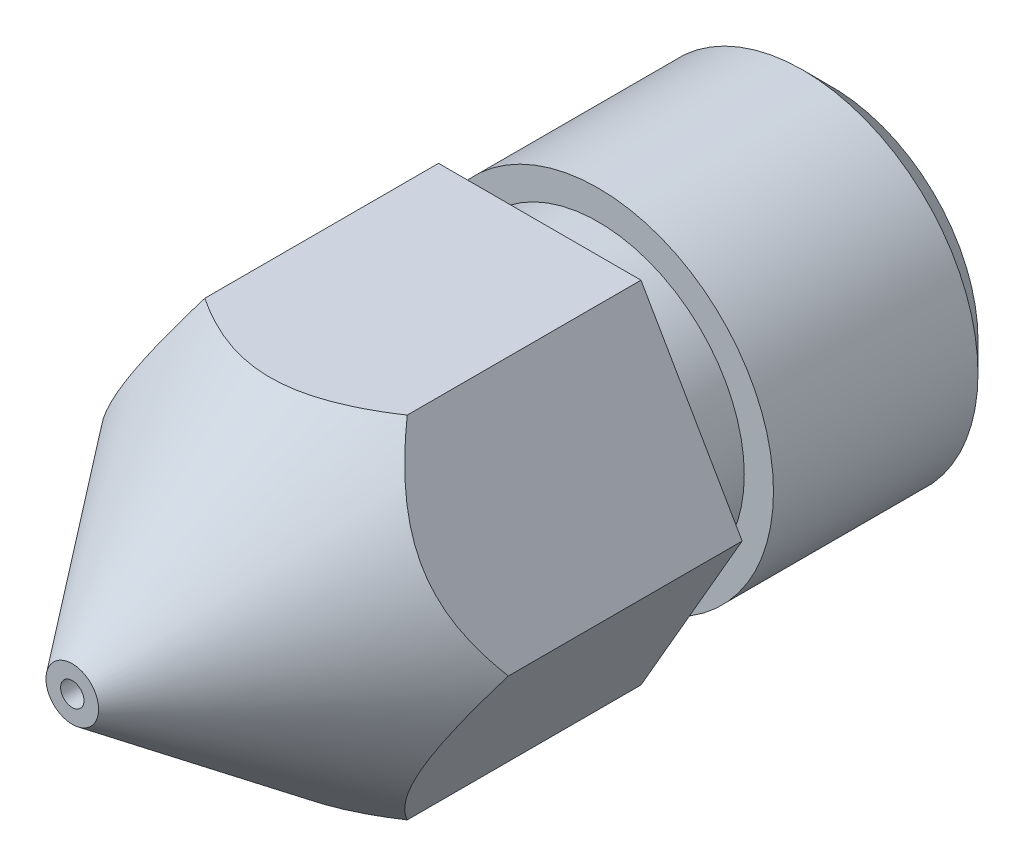
ISO-10303-21;
HEADER;
FILE_DESCRIPTION(('STEP AP214'),'2;1');
FILE_NAME('part.step','',(''),(''),'','','');
FILE_SCHEMA(('AUTOMOTIVE_DESIGN { 1 0 10303 214 1 1 1 1 }'));
ENDSEC;
DATA;
#1=APPLICATION_CONTEXT('core data for automotive mechanical design processes');
#2=APPLICATION_PROTOCOL_DEFINITION('international standard','automotive_design',2000,#1);
#3=PRODUCT_CONTEXT('',#1,'mechanical');
#4=PRODUCT('Part','Part','',(#3));
#5=PRODUCT_RELATED_PRODUCT_CATEGORY('part','',(#4));
#6=PRODUCT_DEFINITION_FORMATION('','',#4);
#7=PRODUCT_DEFINITION_CONTEXT('part definition',#1,'design');
#8=PRODUCT_DEFINITION('design','',#6,#7);
#9=PRODUCT_DEFINITION_SHAPE('','',#8);
#10=(LENGTH_UNIT() NAMED_UNIT(*) SI_UNIT(.MILLI.,.METRE.));
#11=(NAMED_UNIT(*) PLANE_ANGLE_UNIT() SI_UNIT($,.RADIAN.));
#12=(NAMED_UNIT(*) SI_UNIT($,.STERADIAN.) SOLID_ANGLE_UNIT());
#13=UNCERTAINTY_MEASURE_WITH_UNIT(LENGTH_MEASURE(1.E-05),#10,'distance_accuracy_value','');
#14=(GEOMETRIC_REPRESENTATION_CONTEXT(3) GLOBAL_UNCERTAINTY_ASSIGNED_CONTEXT((#13)) GLOBAL_UNIT_ASSIGNED_CONTEXT((#10,
#11,#12)) REPRESENTATION_CONTEXT('',''));
#15=CARTESIAN_POINT('',(0.,0.,0.));
#16=DIRECTION('',(0.,0.,1.));
#17=DIRECTION('',(1.,0.,0.));
#18=AXIS2_PLACEMENT_3D('',#15,#16,#17);
#19=CARTESIAN_POINT('',(0.,0.,0.));
#20=DIRECTION('',(0.,0.,1.));
#21=DIRECTION('',(1.,0.,0.));
#22=AXIS2_PLACEMENT_3D('',#19,#20,#21);
#23=CYLINDRICAL_SURFACE('',#22,2.5);
#24=CARTESIAN_POINT('',(0.,0.,0.));
#25=DIRECTION('',(0.,0.,1.));
#26=DIRECTION('',(1.,0.,0.));
#27=AXIS2_PLACEMENT_3D('',#24,#25,#26);
#28=CIRCLE('',#27,2.5);
#29=CARTESIAN_POINT('',(2.49999999999999,0.,0.));
#30=VERTEX_POINT('',#29);
#31=EDGE_CURVE('E19',#30,#30,#28,.F.);
#32=ORIENTED_EDGE('',*,*,#31,.T.);
#33=EDGE_LOOP('',(#32));
#34=FACE_BOUND('',#33,.T.);
#35=CARTESIAN_POINT('',(0.,0.,-1.));
#36=DIRECTION('',(0.,0.,1.));
#37=DIRECTION('',(1.,0.,0.));
#38=AXIS2_PLACEMENT_3D('',#35,#36,#37);
#39=CIRCLE('',#38,2.5);
#40=CARTESIAN_POINT('',(2.49999999999999,0.,-1.));
#41=VERTEX_POINT('',#40);
#42=EDGE_CURVE('E104',#41,#41,#39,.T.);
#43=ORIENTED_EDGE('',*,*,#42,.T.);
#44=EDGE_LOOP('',(#43));
#45=FACE_BOUND('',#44,.T.);
#46=ADVANCED_FACE('F16',(#34,#45),#23,.T.);
#47=CARTESIAN_POINT('',(0.,0.,0.));
#48=DIRECTION('',(0.,0.,1.));
#49=DIRECTION('',(1.,0.,0.));
#50=AXIS2_PLACEMENT_3D('',#47,#48,#49);
#51=PLANE('',#50);
#52=ORIENTED_EDGE('',*,*,#31,.F.);
#53=EDGE_LOOP('',(#52));
#54=FACE_BOUND('',#53,.T.);
#55=DIRECTION('',(-1.,0.,0.));
#56=VECTOR('',#55,1.);
#57=CARTESIAN_POINT('',(1.73205080756887,3.00000000000001,0.));
#58=LINE('',#57,#56);
#59=CARTESIAN_POINT('',(1.73205080756887,3.00000000000001,0.));
#60=VERTEX_POINT('',#59);
#61=CARTESIAN_POINT('',(-1.73205080756889,2.99999999999999,0.));
#62=VERTEX_POINT('',#61);
#63=EDGE_CURVE('E67',#60,#62,#58,.T.);
#64=ORIENTED_EDGE('',*,*,#63,.F.);
#65=DIRECTION('',(-0.500000000000001,0.866025403784438,0.));
#66=VECTOR('',#65,1.);
#67=CARTESIAN_POINT('',(3.46410161513776,0.,0.));
#68=LINE('',#67,#66);
#69=CARTESIAN_POINT('',(3.46410161513776,0.,0.));
#70=VERTEX_POINT('',#69);
#71=EDGE_CURVE('E97',#70,#60,#68,.T.);
#72=ORIENTED_EDGE('',*,*,#71,.F.);
#73=DIRECTION('',(0.499999999999995,0.866025403784442,0.));
#74=VECTOR('',#73,1.);
#75=CARTESIAN_POINT('',(1.73205080756891,-2.99999999999998,0.));
#76=LINE('',#75,#74);
#77=CARTESIAN_POINT('',(1.73205080756891,-2.99999999999998,0.));
#78=VERTEX_POINT('',#77);
#79=EDGE_CURVE('E102',#78,#70,#76,.T.);
#80=ORIENTED_EDGE('',*,*,#79,.F.);
#81=DIRECTION('',(1.,0.,0.));
#82=VECTOR('',#81,1.);
#83=CARTESIAN_POINT('',(-1.73205080756885,-3.00000000000002,0.));
#84=LINE('',#83,#82);
#85=CARTESIAN_POINT('',(-1.73205080756885,-3.00000000000002,0.));
#86=VERTEX_POINT('',#85);
#87=EDGE_CURVE('E108',#86,#78,#84,.T.);
#88=ORIENTED_EDGE('',*,*,#87,.F.);
#89=DIRECTION('',(0.500000000000007,-0.866025403784435,0.));
#90=VECTOR('',#89,1.);
#91=CARTESIAN_POINT('',(-3.46410161513776,0.,0.));
#92=LINE('',#91,#90);
#93=CARTESIAN_POINT('',(-3.46410161513776,0.,0.));
#94=VERTEX_POINT('',#93);
#95=EDGE_CURVE('E85',#94,#86,#92,.T.);
#96=ORIENTED_EDGE('',*,*,#95,.F.);
#97=DIRECTION('',(-0.499999999999995,-0.866025403784442,0.));
#98=VECTOR('',#97,1.);
#99=CARTESIAN_POINT('',(-1.73205080756889,2.99999999999999,0.));
#100=LINE('',#99,#98);
#101=EDGE_CURVE('E79',#62,#94,#100,.T.);
#102=ORIENTED_EDGE('',*,*,#101,.F.);
#103=EDGE_LOOP('',(#64,#72,#80,#88,#96,#102));
#104=FACE_BOUND('',#103,.T.);
#105=ADVANCED_FACE('F83',(#54,#104),#51,.F.);
#106=CARTESIAN_POINT('',(-3.46410161513776,0.,8.));
#107=DIRECTION('',(-0.866025403784435,-0.500000000000007,0.));
#108=DIRECTION('',(0.500000000000007,-0.866025403784435,0.));
#109=AXIS2_PLACEMENT_3D('',#106,#107,#108);
#110=PLANE('',#109);
#111=ORIENTED_EDGE('',*,*,#95,.T.);
#112=DIRECTION('',(0.,0.,1.));
#113=VECTOR('',#112,1.);
#114=CARTESIAN_POINT('',(-1.73205080756885,-3.00000000000002,8.));
#115=LINE('',#114,#113);
#116=CARTESIAN_POINT('',(-1.73205082261457,-2.99999997394007,4.00000001990856));
#117=VERTEX_POINT('',#116);
#118=EDGE_CURVE('E110',#117,#86,#115,.F.);
#119=ORIENTED_EDGE('',*,*,#118,.F.);
#120=CARTESIAN_POINT('',(-3.46410161512749,-1.78090844095584E-11,3.99999999995585));
#121=CARTESIAN_POINT('',(-3.44069021728598,-0.0405497305555014,4.0310628053538));
#122=CARTESIAN_POINT('',(-3.41706085238584,-0.0814769911131405,4.06148013029268));
#123=CARTESIAN_POINT('',(-3.36934820183696,-0.16411772602758,4.12079172064874));
#124=CARTESIAN_POINT('',(-3.34526518086492,-0.205830741950901,4.14968683895466));
#125=CARTESIAN_POINT('',(-3.29644056578324,-0.290397455932351,4.20594219265243));
#126=CARTESIAN_POINT('',(-3.27169567941122,-0.333256856356211,4.23329106871594));
#127=CARTESIAN_POINT('',(-3.22165527143299,-0.419929385405982,4.28600265818764));
#128=CARTESIAN_POINT('',(-3.19635926529786,-0.463743353260596,4.31136352565853));
#129=CARTESIAN_POINT('',(-3.11910484462331,-0.597551934978225,4.3845024985927));
#130=CARTESIAN_POINT('',(-3.06628459171059,-0.689039296691687,4.42874210619825));
#131=CARTESIAN_POINT('',(-2.95848675569459,-0.875750625617379,4.50488649686758));
#132=CARTESIAN_POINT('',(-2.9035124162864,-0.970968974584896,4.53680909624767));
#133=CARTESIAN_POINT('',(-2.81448457704596,-1.1251697154374,4.57560860596397));
#134=CARTESIAN_POINT('',(-2.78095977027534,-1.18323638407805,4.58739343695509));
#135=CARTESIAN_POINT('',(-2.71351247814955,-1.30005852087285,4.60510403197278));
#136=CARTESIAN_POINT('',(-2.67958993696148,-1.35881408573244,4.61102896319209));
#137=CARTESIAN_POINT('',(-2.61188290906255,-1.47608609808287,4.61672020179017));
#138=CARTESIAN_POINT('',(-2.57809943786469,-1.5346007866536,4.61653462503732));
#139=CARTESIAN_POINT('',(-2.51067843635983,-1.6513773867572,4.61013433411967));
#140=CARTESIAN_POINT('',(-2.47704090125166,-1.70963930660593,4.6039198198358));
#141=CARTESIAN_POINT('',(-2.41030893019044,-1.82522247097317,4.58577671747795));
#142=CARTESIAN_POINT('',(-2.37721275011841,-1.88254673639436,4.57387352526923));
#143=CARTESIAN_POINT('',(-2.31159334327444,-1.99620288301066,4.54483585433414));
#144=CARTESIAN_POINT('',(-2.27907037936965,-2.05253430890648,4.52769903835235));
#145=CARTESIAN_POINT('',(-2.18215411721515,-2.22039819903774,4.46905909519213));
#146=CARTESIAN_POINT('',(-2.11882576441585,-2.33008612364577,4.42045072352064));
#147=CARTESIAN_POINT('',(-1.99999917816462,-2.53589980832286,4.313482497851));
#148=CARTESIAN_POINT('',(-1.94426869692903,-2.63242783335316,4.25611473073038));
#149=CARTESIAN_POINT('',(-1.86291673372508,-2.77333356691788,4.16391653954198));
#150=CARTESIAN_POINT('',(-1.83634125898785,-2.81936363939803,4.13238684651579));
#151=CARTESIAN_POINT('',(-1.78377384701409,-2.91041306775898,4.06749851398277));
#152=CARTESIAN_POINT('',(-1.75778159469871,-2.95543296937237,4.03414089723963));
#153=CARTESIAN_POINT('',(-1.73205083766029,-2.99999994788013,4.0000000398749));
#154=B_SPLINE_CURVE_WITH_KNOTS('',3,(#120,#121,#122,#123,#124,#125,#126,#127,#128,#129,#130,
#131,#132,#133,#134,#135,#136,#137,#138,#139,#140,#141,#142,#143,#144,#145,#146,#147,#148,#149,
#150,#151,#152,#153),.UNSPECIFIED.,.F.,.F.,(4,2,2,2,2,2,2,2,2,2,2,2,2,2,2,2,4),(0.,
0.168572565033998,0.337049652156391,0.506636087692028,0.676378169632626,1.01936499807178,
1.36185382588792,1.56586036237278,1.7698958880427,1.9723251673403,2.17474773560912,
2.37627495577819,2.57789230681761,2.98360296012187,3.3591882030421,3.54455388709552,
3.72981689344194),.UNSPECIFIED.);
#155=CARTESIAN_POINT('',(-3.46410161513399,0.,3.99999999996893));
#156=VERTEX_POINT('',#155);
#157=EDGE_CURVE('E87',#156,#117,#154,.T.);
#158=ORIENTED_EDGE('',*,*,#157,.F.);
#159=DIRECTION('',(0.,0.,1.));
#160=VECTOR('',#159,1.);
#161=CARTESIAN_POINT('',(-3.46410161513776,0.,8.));
#162=LINE('',#161,#160);
#163=EDGE_CURVE('E33',#94,#156,#162,.T.);
#164=ORIENTED_EDGE('',*,*,#163,.F.);
#165=EDGE_LOOP('',(#111,#119,#158,#164));
#166=FACE_BOUND('',#165,.T.);
#167=ADVANCED_FACE('F183',(#166),#110,.T.);
#168=CARTESIAN_POINT('',(-1.73205080756885,-3.00000000000002,8.));
#169=DIRECTION('',(0.,-1.,0.));
#170=DIRECTION('',(1.,0.,0.));
#171=AXIS2_PLACEMENT_3D('',#168,#169,#170);
#172=PLANE('',#171);
#173=ORIENTED_EDGE('',*,*,#87,.T.);
#174=DIRECTION('',(0.,0.,1.));
#175=VECTOR('',#174,1.);
#176=CARTESIAN_POINT('',(1.73205080756891,-2.99999999999998,8.));
#177=LINE('',#176,#175);
#178=CARTESIAN_POINT('',(1.73205077747104,-2.99999999999998,4.00000001991283));
#179=VERTEX_POINT('',#178);
#180=EDGE_CURVE('E105',#179,#78,#177,.F.);
#181=ORIENTED_EDGE('',*,*,#180,.F.);
#182=CARTESIAN_POINT('',(-1.73205080390475,-2.99999997395749,3.99999998902961));
#183=CARTESIAN_POINT('',(-1.68522801225279,-2.9999999906465,4.03106280033602));
#184=CARTESIAN_POINT('',(-1.63796928421497,-2.99999999749357,4.06148012765403));
#185=CARTESIAN_POINT('',(-1.54254398469325,-3.00000000250505,4.12079171963457));
#186=CARTESIAN_POINT('',(-1.4943779425648,-3.00000000067438,4.1496868371891));
#187=CARTESIAN_POINT('',(-1.39672871265291,-2.99999999932121,4.2059421901906));
#188=CARTESIAN_POINT('',(-1.34723894034983,-2.99999999981398,4.23329106631756));
#189=CARTESIAN_POINT('',(-1.24715812512532,-3.00000000018622,4.28600265574057));
#190=CARTESIAN_POINT('',(-1.19656611314546,-3.00000000006513,4.31136352309826));
#191=CARTESIAN_POINT('',(-1.04205727283146,-2.99999999986843,4.38450249576049));
#192=CARTESIAN_POINT('',(-0.936416767816112,-2.99999999996537,4.42874210333507));
#193=CARTESIAN_POINT('',(-0.720821097463859,-3.00000000003459,4.50488649411916));
#194=CARTESIAN_POINT('',(-0.610872419518798,-3.00000000000705,4.53680909364931));
#195=CARTESIAN_POINT('',(-0.432816742046975,-2.99999999999581,4.57560860393632));
#196=CARTESIAN_POINT('',(-0.365767128635706,-2.99999999999888,4.58739343521679));
#197=CARTESIAN_POINT('',(-0.230872544635614,-3.00000000000113,4.60510403084387));
#198=CARTESIAN_POINT('',(-0.16302746238116,-3.0000000000003,4.61102896238462));
#199=CARTESIAN_POINT('',(-0.0276134067728522,-2.9999999999997,4.61672020164859));
#200=CARTESIAN_POINT('',(0.0399535355548584,-2.99999999999992,4.61653462523792));
#201=CARTESIAN_POINT('',(0.174795538465503,-3.00000000000008,4.61013433500813));
#202=CARTESIAN_POINT('',(0.242070608650749,-3.00000000000002,4.60391982106944));
#203=CARTESIAN_POINT('',(0.375534550747317,-2.99999999999998,4.58577671938737));
#204=CARTESIAN_POINT('',(0.441726910896373,-2.99999999999999,4.57387352750857));
#205=CARTESIAN_POINT('',(0.572965724614914,-3.,4.54483585721002));
#206=CARTESIAN_POINT('',(0.638011652450085,-3.,4.52769904153483));
#207=CARTESIAN_POINT('',(0.831844176842158,-2.99999999999999,4.4690590992579));
#208=CARTESIAN_POINT('',(0.958500882518724,-2.99999999999999,4.42045072812008));
#209=CARTESIAN_POINT('',(1.19615405717397,-2.99999999999999,4.31348250246958));
#210=CARTESIAN_POINT('',(1.30761502162218,-2.99999999999999,4.25611473463496));
#211=CARTESIAN_POINT('',(1.47031895084624,-2.99999999999998,4.16391654213468));
#212=CARTESIAN_POINT('',(1.52346990122852,-2.99999999999998,4.13238684863528));
#213=CARTESIAN_POINT('',(1.62860472694999,-2.99999999999998,4.06749851509162));
#214=CARTESIAN_POINT('',(1.68058923244697,-2.99999999999998,4.03414089781116));
#215=CARTESIAN_POINT('',(1.73205074737316,-2.99999999999998,4.00000003988345));
#216=B_SPLINE_CURVE_WITH_KNOTS('',3,(#182,#183,#184,#185,#186,#187,#188,#189,#190,#191,#192,
#193,#194,#195,#196,#197,#198,#199,#200,#201,#202,#203,#204,#205,#206,#207,#208,#209,#210,#211,
#212,#213,#214,#215),.UNSPECIFIED.,.F.,.F.,(4,2,2,2,2,2,2,2,2,2,2,2,2,2,2,2,4),(0.,
0.168572564445729,0.337049650810836,0.50663608532369,0.676378166317596,1.01936499251818,
1.36185381797032,1.56586035422516,1.76989587961715,1.97232515870881,2.17474772678902,
2.37627494679629,2.57789229767387,2.98360295060958,3.35918819974785,3.54455388686658,
3.72981689626899),.UNSPECIFIED.);
#217=EDGE_CURVE('E169',#117,#179,#216,.T.);
#218=ORIENTED_EDGE('',*,*,#217,.F.);
#219=ORIENTED_EDGE('',*,*,#118,.T.);
#220=EDGE_LOOP('',(#173,#181,#218,#219));
#221=FACE_BOUND('',#220,.T.);
#222=ADVANCED_FACE('F178',(#221),#172,.T.);
#223=CARTESIAN_POINT('',(1.73205080756891,-2.99999999999998,8.));
#224=DIRECTION('',(0.866025403784442,-0.499999999999995,0.));
#225=DIRECTION('',(0.499999999999995,0.866025403784442,0.));
#226=AXIS2_PLACEMENT_3D('',#223,#224,#225);
#227=PLANE('',#226);
#228=ORIENTED_EDGE('',*,*,#79,.T.);
#229=DIRECTION('',(0.,0.,1.));
#230=VECTOR('',#229,1.);
#231=CARTESIAN_POINT('',(3.46410161513776,0.,8.));
#232=LINE('',#231,#230);
#233=CARTESIAN_POINT('',(3.46410161513021,0.,3.99999999995224));
#234=VERTEX_POINT('',#233);
#235=EDGE_CURVE('E99',#234,#70,#232,.F.);
#236=ORIENTED_EDGE('',*,*,#235,.F.);
#237=CARTESIAN_POINT('',(1.73205078683702,-2.9999999838129,3.99999998901916));
#238=CARTESIAN_POINT('',(1.75546219711762,-2.95945026511495,4.03106280032556));
#239=CARTESIAN_POINT('',(1.77909156706624,-2.91852300951005,4.0614801276429));
#240=CARTESIAN_POINT('',(1.82680422116572,-2.83588227847082,4.12079171962161));
#241=CARTESIAN_POINT('',(1.85088724064311,-2.79416926147422,4.14968683717497));
#242=CARTESIAN_POINT('',(1.89971185442462,-2.70960254703781,4.2059421901745));
#243=CARTESIAN_POINT('',(1.92445674100179,-2.66674314724437,4.23329106630065));
#244=CARTESIAN_POINT('',(1.97449714893402,-2.58007061901892,4.28600265572225));
#245=CARTESIAN_POINT('',(1.99979315481781,-2.5362566513574,4.31136352307933));
#246=CARTESIAN_POINT('',(2.07704757480595,-2.40244807043521,4.38450249574526));
#247=CARTESIAN_POINT('',(2.12986782740052,-2.31096070946671,4.42874210332363));
#248=CARTESIAN_POINT('',(2.23766566264272,-2.12424938201975,4.50488649411404));
#249=CARTESIAN_POINT('',(2.2926400015946,-2.0290310337875,4.53680909364672));
#250=CARTESIAN_POINT('',(2.38166784032611,-1.87483029379397,4.57560860393638));
#251=CARTESIAN_POINT('',(2.41519264703649,-1.81676362526382,4.58739343521754));
#252=CARTESIAN_POINT('',(2.48263993904267,-1.69994148868068,4.60510403084524));
#253=CARTESIAN_POINT('',(2.51656248017129,-1.64118592392241,4.61102896238593));
#254=CARTESIAN_POINT('',(2.58426950797496,-1.52391391173578,4.61672020164866));
#255=CARTESIAN_POINT('',(2.61805297913691,-1.46539922322767,4.61653462523756));
#256=CARTESIAN_POINT('',(2.68547398058824,-1.34862262321711,4.61013433500767));
#257=CARTESIAN_POINT('',(2.71911151567878,-1.2903607033988,4.60391982106929));
#258=CARTESIAN_POINT('',(2.78584348671839,-1.17477753906889,4.58577671938979));
#259=CARTESIAN_POINT('',(2.81893966678639,-1.11745327365469,4.57387352751402));
#260=CARTESIAN_POINT('',(2.88455907363292,-1.00379712703399,4.54483585722354));
#261=CARTESIAN_POINT('',(2.9170820375443,-0.947465701126749,4.52769904155341));
#262=CARTESIAN_POINT('',(3.01399829974689,-0.779601810912185,4.46905909927857));
#263=CARTESIAN_POINT('',(3.07732665259602,-0.669913886217841,4.42045072813286));
#264=CARTESIAN_POINT('',(3.19615324550639,-0.464100190006776,4.31348249746097));
#265=CARTESIAN_POINT('',(3.25188373303114,-0.367572154083333,4.25611472345713));
#266=CARTESIAN_POINT('',(3.33323570517356,-0.226666405036735,4.16391652072528));
#267=CARTESIAN_POINT('',(3.35981118277317,-0.180636327598797,4.13238682370177));
#268=CARTESIAN_POINT('',(3.41237860034698,-0.0895868895382563,4.06749848284485));
#269=CARTESIAN_POINT('',(3.43837085540024,-0.0445669831827226,4.03414086177575));
#270=CARTESIAN_POINT('',(3.46410161512749,-1.77906543640029E-11,3.99999999995585));
#271=B_SPLINE_CURVE_WITH_KNOTS('',3,(#237,#238,#239,#240,#241,#242,#243,#244,#245,#246,#247,
#248,#249,#250,#251,#252,#253,#254,#255,#256,#257,#258,#259,#260,#261,#262,#263,#264,#265,#266,
#267,#268,#269,#270),.UNSPECIFIED.,.F.,.F.,(4,2,2,2,2,2,2,2,2,2,2,2,2,2,2,2,4),(0.,
0.168572564438344,0.337049650796003,0.50663608530132,0.676378166287717,1.01936499250879,
1.36185381798131,1.56586035424876,1.76989587965327,1.97232515873247,2.17474772680038,
2.37627494676785,2.57789229760461,2.98360295062125,3.35918823635118,3.54455394128791,
3.72981696846106),.UNSPECIFIED.);
#272=EDGE_CURVE('E164',#179,#234,#271,.T.);
#273=ORIENTED_EDGE('',*,*,#272,.F.);
#274=ORIENTED_EDGE('',*,*,#180,.T.);
#275=EDGE_LOOP('',(#228,#236,#273,#274));
#276=FACE_BOUND('',#275,.T.);
#277=ADVANCED_FACE('F175',(#276),#227,.T.);
#278=CARTESIAN_POINT('',(2.99999999999999,0.,-1.));
#279=DIRECTION('',(0.,0.,-1.));
#280=DIRECTION('',(-1.,0.,0.));
#281=AXIS2_PLACEMENT_3D('',#278,#279,#280);
#282=PLANE('',#281);
#283=CARTESIAN_POINT('',(0.,0.,-1.));
#284=DIRECTION('',(0.,0.,1.));
#285=DIRECTION('',(1.,0.,0.));
#286=AXIS2_PLACEMENT_3D('',#283,#284,#285);
#287=CIRCLE('',#286,2.99999999999999);
#288=CARTESIAN_POINT('',(2.99999999999999,0.,-1.));
#289=VERTEX_POINT('',#288);
#290=EDGE_CURVE('E161',#289,#289,#287,.F.);
#291=ORIENTED_EDGE('',*,*,#290,.F.);
#292=EDGE_LOOP('',(#291));
#293=FACE_BOUND('',#292,.T.);
#294=ORIENTED_EDGE('',*,*,#42,.F.);
#295=EDGE_LOOP('',(#294));
#296=FACE_BOUND('',#295,.T.);
#297=ADVANCED_FACE('F153',(#293,#296),#282,.F.);
#298=CARTESIAN_POINT('',(3.46410161513776,0.,8.));
#299=DIRECTION('',(0.866025403784438,0.500000000000001,0.));
#300=DIRECTION('',(-0.500000000000001,0.866025403784438,0.));
#301=AXIS2_PLACEMENT_3D('',#298,#299,#300);
#302=PLANE('',#301);
#303=ORIENTED_EDGE('',*,*,#71,.T.);
#304=DIRECTION('',(0.,0.,1.));
#305=VECTOR('',#304,1.);
#306=CARTESIAN_POINT('',(1.73205080756887,3.00000000000001,8.));
#307=LINE('',#306,#305);
#308=CARTESIAN_POINT('',(1.73205082261745,2.9999999739351,4.00000001991236));
#309=VERTEX_POINT('',#308);
#310=EDGE_CURVE('E73',#309,#60,#307,.F.);
#311=ORIENTED_EDGE('',*,*,#310,.F.);
#312=CARTESIAN_POINT('',(3.46410161512749,1.77913089255884E-11,3.99999999995585));
#313=CARTESIAN_POINT('',(3.44069021728598,0.040549730555484,4.03106280535381));
#314=CARTESIAN_POINT('',(3.41706085238583,0.0814769911131235,4.06148013029268));
#315=CARTESIAN_POINT('',(3.36934820183695,0.164117726027563,4.12079172064874));
#316=CARTESIAN_POINT('',(3.34526518086491,0.205830741950885,4.14968683895466));
#317=CARTESIAN_POINT('',(3.29644056578324,0.290397455932336,4.20594219265243));
#318=CARTESIAN_POINT('',(3.27169567941122,0.333256856356197,4.23329106871595));
#319=CARTESIAN_POINT('',(3.22165527143299,0.419929385405969,4.28600265818764));
#320=CARTESIAN_POINT('',(3.19635926529786,0.463743353260583,4.31136352565853));
#321=CARTESIAN_POINT('',(3.1191048446233,0.597551934978212,4.3845024985927));
#322=CARTESIAN_POINT('',(3.06628459171059,0.689039296691673,4.42874210619826));
#323=CARTESIAN_POINT('',(2.95848675569459,0.875750625617363,4.50488649686758));
#324=CARTESIAN_POINT('',(2.9035124162864,0.970968974584879,4.53680909624767));
#325=CARTESIAN_POINT('',(2.81448457704597,1.12516971543738,4.57560860596397));
#326=CARTESIAN_POINT('',(2.78095977027535,1.18323638407803,4.58739343695509));
#327=CARTESIAN_POINT('',(2.71351247814956,1.30005852087283,4.60510403197278));
#328=CARTESIAN_POINT('',(2.67958993696149,1.35881408573242,4.61102896319209));
#329=CARTESIAN_POINT('',(2.61188290906256,1.47608609808285,4.61672020179017));
#330=CARTESIAN_POINT('',(2.5780994378647,1.53460078665358,4.61653462503732));
#331=CARTESIAN_POINT('',(2.51067843635984,1.65137738675718,4.61013433411967));
#332=CARTESIAN_POINT('',(2.47704090125167,1.70963930660591,4.6039198198358));
#333=CARTESIAN_POINT('',(2.41030893019045,1.82522247097316,4.58577671747795));
#334=CARTESIAN_POINT('',(2.37721275011842,1.88254673639435,4.57387352526923));
#335=CARTESIAN_POINT('',(2.31159334327445,1.99620288301065,4.54483585433414));
#336=CARTESIAN_POINT('',(2.27907037936966,2.05253430890647,4.52769903835235));
#337=CARTESIAN_POINT('',(2.18215411721516,2.22039819903773,4.46905909519213));
#338=CARTESIAN_POINT('',(2.11882576441586,2.33008612364576,4.42045072352064));
#339=CARTESIAN_POINT('',(1.9999991781657,2.53589980832101,4.31348249785196));
#340=CARTESIAN_POINT('',(1.94426869693112,2.63242783334956,4.25611473073251));
#341=CARTESIAN_POINT('',(1.8629167337286,2.7733335669118,4.16391653954606));
#342=CARTESIAN_POINT('',(1.83634125899183,2.81936363939115,4.13238684652054));
#343=CARTESIAN_POINT('',(1.78377384701897,2.91041306775054,4.06749851398892));
#344=CARTESIAN_POINT('',(1.75778159470403,2.95543296936317,4.03414089724649));
#345=CARTESIAN_POINT('',(1.73205083766604,2.99999994787019,4.00000003988251));
#346=B_SPLINE_CURVE_WITH_KNOTS('',3,(#312,#313,#314,#315,#316,#317,#318,#319,#320,#321,#322,
#323,#324,#325,#326,#327,#328,#329,#330,#331,#332,#333,#334,#335,#336,#337,#338,#339,#340,#341,
#342,#343,#344,#345),.UNSPECIFIED.,.F.,.F.,(4,2,2,2,2,2,2,2,2,2,2,2,2,2,2,2,4),(0.,
0.168572565033999,0.337049652156393,0.506636087692031,0.67637816963263,1.01936499807178,
1.36185382588791,1.56586036237277,1.76989588804269,1.97232516734029,2.17474773560911,
2.37627495577819,2.57789230681762,2.98360296012186,3.35918820303512,3.54455388708515,
3.72981689342818),.UNSPECIFIED.);
#347=EDGE_CURVE('E156',#234,#309,#346,.T.);
#348=ORIENTED_EDGE('',*,*,#347,.F.);
#349=ORIENTED_EDGE('',*,*,#235,.T.);
#350=EDGE_LOOP('',(#303,#311,#348,#349));
#351=FACE_BOUND('',#350,.T.);
#352=ADVANCED_FACE('F149',(#351),#302,.T.);
#353=CARTESIAN_POINT('',(1.73205080756887,3.00000000000001,8.));
#354=DIRECTION('',(0.,1.,0.));
#355=DIRECTION('',(-1.,0.,0.));
#356=AXIS2_PLACEMENT_3D('',#353,#354,#355);
#357=PLANE('',#356);
#358=ORIENTED_EDGE('',*,*,#63,.T.);
#359=DIRECTION('',(0.,0.,1.));
#360=VECTOR('',#359,1.);
#361=CARTESIAN_POINT('',(-1.73205080756889,2.99999999999999,8.));
#362=LINE('',#361,#360);
#363=CARTESIAN_POINT('',(-1.73205077747843,2.99999999999999,4.00000001990792));
#364=VERTEX_POINT('',#363);
#365=EDGE_CURVE('E71',#364,#62,#362,.F.);
#366=ORIENTED_EDGE('',*,*,#365,.F.);
#367=CARTESIAN_POINT('',(1.73205080391511,2.99999997395271,3.99999998902031));
#368=CARTESIAN_POINT('',(1.68522801226358,2.99999999064478,4.03106280032815));
#369=CARTESIAN_POINT('',(1.63796928422576,2.9999999974931,4.06148012764695));
#370=CARTESIAN_POINT('',(1.54254398470369,3.0000000025055,4.12079171962848));
#371=CARTESIAN_POINT('',(1.49437794257489,3.0000000006745,4.14968683718321));
#372=CARTESIAN_POINT('',(1.39672871266237,2.99999999932107,4.20594219018526));
#373=CARTESIAN_POINT('',(1.34723894035902,2.99999999981393,4.23329106631256));
#374=CARTESIAN_POINT('',(1.24715812513394,3.00000000018625,4.28600265573621));
#375=CARTESIAN_POINT('',(1.19656611315377,3.00000000006514,4.31136352309419));
#376=CARTESIAN_POINT('',(1.04205727283882,2.9999999998684,4.38450249575731));
#377=CARTESIAN_POINT('',(0.936416767822808,2.99999999996536,4.42874210333246));
#378=CARTESIAN_POINT('',(0.720821097469165,3.0000000000346,4.50488649411755));
#379=CARTESIAN_POINT('',(0.610872419523375,3.00000000000705,4.53680909364814));
#380=CARTESIAN_POINT('',(0.432816742050784,2.9999999999958,4.5756086039356));
#381=CARTESIAN_POINT('',(0.365767128639503,2.99999999999888,4.58739343521618));
#382=CARTESIAN_POINT('',(0.230872544639381,3.00000000000113,4.60510403084349));
#383=CARTESIAN_POINT('',(0.163027462384909,3.0000000000003,4.61102896238436));
#384=CARTESIAN_POINT('',(0.0276134067765566,2.9999999999997,4.61672020164855));
#385=CARTESIAN_POINT('',(-0.0399535355511795,2.99999999999992,4.61653462523799));
#386=CARTESIAN_POINT('',(-0.174795538461885,3.00000000000008,4.61013433500841));
#387=CARTESIAN_POINT('',(-0.242070608647167,3.00000000000002,4.60391982106982));
#388=CARTESIAN_POINT('',(-0.375534550743816,2.99999999999998,4.58577671938794));
#389=CARTESIAN_POINT('',(-0.441726910892917,2.99999999999999,4.57387352750923));
#390=CARTESIAN_POINT('',(-0.572965724611553,3.,4.54483585721085));
#391=CARTESIAN_POINT('',(-0.638011652446773,3.,4.52769904153574));
#392=CARTESIAN_POINT('',(-0.831844176839013,2.99999999999999,4.46905909925901));
#393=CARTESIAN_POINT('',(-0.958500882515699,3.,4.4204507281213));
#394=CARTESIAN_POINT('',(-1.19615405717434,3.,4.31348250246953));
#395=CARTESIAN_POINT('',(-1.30761502162567,3.,4.2561147346332));
#396=CARTESIAN_POINT('',(-1.47031895085417,3.,4.16391654213006));
#397=CARTESIAN_POINT('',(-1.52346990123786,3.,4.13238684862967));
#398=CARTESIAN_POINT('',(-1.62860472696211,2.99999999999999,4.06749851508396));
#399=CARTESIAN_POINT('',(-1.68058923246044,2.99999999999999,4.03414089780242));
#400=CARTESIAN_POINT('',(-1.73205074738797,2.99999999999999,4.00000003987361));
#401=B_SPLINE_CURVE_WITH_KNOTS('',3,(#367,#368,#369,#370,#371,#372,#373,#374,#375,#376,#377,
#378,#379,#380,#381,#382,#383,#384,#385,#386,#387,#388,#389,#390,#391,#392,#393,#394,#395,#396,
#397,#398,#399,#400),.UNSPECIFIED.,.F.,.F.,(4,2,2,2,2,2,2,2,2,2,2,2,2,2,2,2,4),(0.,
0.168572564446985,0.337049650813314,0.506636085327373,0.6763781663225,1.01936499252557,
1.36185381798016,1.56586035423509,1.76989587962717,1.9723251587189,2.17474772679919,
2.37627494680655,2.5778922976842,2.98360295062013,3.35918819976902,3.54455388689293,
3.72981689630049),.UNSPECIFIED.);
#402=EDGE_CURVE('E133',#309,#364,#401,.T.);
#403=ORIENTED_EDGE('',*,*,#402,.F.);
#404=ORIENTED_EDGE('',*,*,#310,.T.);
#405=EDGE_LOOP('',(#358,#366,#403,#404));
#406=FACE_BOUND('',#405,.T.);
#407=ADVANCED_FACE('F69',(#406),#357,.T.);
#408=CARTESIAN_POINT('',(-1.73205080756889,2.99999999999999,8.));
#409=DIRECTION('',(-0.866025403784442,0.499999999999995,0.));
#410=DIRECTION('',(-0.499999999999995,-0.866025403784442,0.));
#411=AXIS2_PLACEMENT_3D('',#408,#409,#410);
#412=PLANE('',#411);
#413=ORIENTED_EDGE('',*,*,#101,.T.);
#414=ORIENTED_EDGE('',*,*,#163,.T.);
#415=CARTESIAN_POINT('',(-1.73205078684902,2.99999998380441,3.99999998903119));
#416=CARTESIAN_POINT('',(-1.75546219712648,2.95945026510401,4.03106280033573));
#417=CARTESIAN_POINT('',(-1.7790915670737,2.9185230094983,4.06148012765206));
#418=CARTESIAN_POINT('',(-1.82680422117192,2.83588227845886,4.12079171962949));
#419=CARTESIAN_POINT('',(-1.85088724064946,2.79416926146288,4.14968683718259));
#420=CARTESIAN_POINT('',(-1.89971185443085,2.70960254702733,4.20594219018142));
#421=CARTESIAN_POINT('',(-1.92445674100774,2.66674314723413,4.23329106630712));
#422=CARTESIAN_POINT('',(-1.97449714893952,2.58007061900928,4.28600265572789));
#423=CARTESIAN_POINT('',(-1.99979315482314,2.53625665134812,4.31136352308459));
#424=CARTESIAN_POINT('',(-2.0770475748107,2.40244807042701,4.38450249574939));
#425=CARTESIAN_POINT('',(-2.12986782740482,2.31096070945925,4.42874210332703));
#426=CARTESIAN_POINT('',(-2.23766566264612,2.12424938201382,4.50488649411614));
#427=CARTESIAN_POINT('',(-2.29264000159753,2.02903103378239,4.53680909364826));
#428=CARTESIAN_POINT('',(-2.38166784032855,1.87483029378972,4.57560860393733));
#429=CARTESIAN_POINT('',(-2.41519264703892,1.81676362525958,4.58739343521834));
#430=CARTESIAN_POINT('',(-2.48263993904508,1.69994148867647,4.60510403084575));
#431=CARTESIAN_POINT('',(-2.51656248017369,1.64118592391822,4.61102896238629));
#432=CARTESIAN_POINT('',(-2.58426950797733,1.52391391173164,4.61672020164873));
#433=CARTESIAN_POINT('',(-2.61805297913927,1.46539922322357,4.6165346252375));
#434=CARTESIAN_POINT('',(-2.68547398059056,1.34862262321307,4.61013433500732));
#435=CARTESIAN_POINT('',(-2.71911151568107,1.29036070339481,4.60391982106882));
#436=CARTESIAN_POINT('',(-2.78584348672063,1.17477753906499,4.58577671938907));
#437=CARTESIAN_POINT('',(-2.8189396667886,1.11745327365085,4.57387352751318));
#438=CARTESIAN_POINT('',(-2.88455907363506,1.00379712703026,4.54483585722248));
#439=CARTESIAN_POINT('',(-2.91708203754641,0.947465701123077,4.52769904155225));
#440=CARTESIAN_POINT('',(-3.01399829974889,0.779601810908697,4.46905909927715));
#441=CARTESIAN_POINT('',(-3.07732665259795,0.669913886214482,4.42045072813131));
#442=CARTESIAN_POINT('',(-3.1961532455079,0.464100190004136,4.31348249745946));
#443=CARTESIAN_POINT('',(-3.25188373303232,0.36757215408126,4.25611472345586));
#444=CARTESIAN_POINT('',(-3.33323570517427,0.226666405035468,4.16391652072444));
#445=CARTESIAN_POINT('',(-3.35981118277374,0.180636327597788,4.13238682370108));
#446=CARTESIAN_POINT('',(-3.41237860034726,0.089586889537751,4.06749848284449));
#447=CARTESIAN_POINT('',(-3.43837085540038,0.0445669831824632,4.03414086177557));
#448=CARTESIAN_POINT('',(-3.46410161512748,1.77726889726725E-11,3.99999999995585));
#449=B_SPLINE_CURVE_WITH_KNOTS('',3,(#415,#416,#417,#418,#419,#420,#421,#422,#423,#424,#425,
#426,#427,#428,#429,#430,#431,#432,#433,#434,#435,#436,#437,#438,#439,#440,#441,#442,#443,#444,
#445,#446,#447,#448),.UNSPECIFIED.,.F.,.F.,(4,2,2,2,2,2,2,2,2,2,2,2,2,2,2,2,4),(0.,
0.16857256443672,0.3370496507928,0.50663608529656,0.676378166281376,1.01936499249925,
1.36185381796861,1.56586035423594,1.76989587964034,1.97232515871945,2.17474772678725,
2.37627494675459,2.57789229759124,2.98360295060762,3.35918823633549,3.54455394127122,
3.72981696844336),.UNSPECIFIED.);
#450=EDGE_CURVE('E81',#364,#156,#449,.T.);
#451=ORIENTED_EDGE('',*,*,#450,.F.);
#452=ORIENTED_EDGE('',*,*,#365,.T.);
#453=EDGE_LOOP('',(#413,#414,#451,#452));
#454=FACE_BOUND('',#453,.T.);
#455=ADVANCED_FACE('F78',(#454),#412,.T.);
#456=CARTESIAN_POINT('',(0.,0.,-5.));
#457=DIRECTION('',(0.,0.,1.));
#458=DIRECTION('',(1.,0.,0.));
#459=AXIS2_PLACEMENT_3D('',#456,#457,#458);
#460=CYLINDRICAL_SURFACE('',#459,2.99999999999999);
#461=ORIENTED_EDGE('',*,*,#290,.T.);
#462=EDGE_LOOP('',(#461));
#463=FACE_BOUND('',#462,.T.);
#464=CARTESIAN_POINT('',(0.,0.,-4.50000000000728));
#465=DIRECTION('',(0.,0.,1.));
#466=DIRECTION('',(1.,0.,0.));
#467=AXIS2_PLACEMENT_3D('',#464,#465,#466);
#468=CIRCLE('',#467,2.9999999999859);
#469=CARTESIAN_POINT('',(2.9999999999859,0.,-4.50000000000728));
#470=VERTEX_POINT('',#469);
#471=EDGE_CURVE('E126',#470,#470,#468,.F.);
#472=ORIENTED_EDGE('',*,*,#471,.F.);
#473=EDGE_LOOP('',(#472));
#474=FACE_BOUND('',#473,.T.);
#475=ADVANCED_FACE('F145',(#463,#474),#460,.T.);
#476=CARTESIAN_POINT('',(0.,0.,3.97599999996601));
#477=DIRECTION('',(0.,0.,-1.));
#478=DIRECTION('',(-1.,0.,0.));
#479=AXIS2_PLACEMENT_3D('',#476,#477,#478);
#480=CONICAL_SURFACE('',#479,3.48218691232205,0.645771823231257);
#481=ORIENTED_EDGE('',*,*,#272,.T.);
#482=ORIENTED_EDGE('',*,*,#347,.T.);
#483=ORIENTED_EDGE('',*,*,#402,.T.);
#484=ORIENTED_EDGE('',*,*,#450,.T.);
#485=ORIENTED_EDGE('',*,*,#157,.T.);
#486=ORIENTED_EDGE('',*,*,#217,.T.);
#487=EDGE_LOOP('',(#481,#482,#483,#484,#485,#486));
#488=FACE_BOUND('',#487,.T.);
#489=CARTESIAN_POINT('',(0.,0.,8.0000000000382));
#490=DIRECTION('',(0.,0.,-1.));
#491=DIRECTION('',(-1.,0.,0.));
#492=AXIS2_PLACEMENT_3D('',#489,#490,#491);
#493=CIRCLE('',#492,0.449885414695927);
#494=CARTESIAN_POINT('',(-0.449885414695927,0.,8.0000000000382));
#495=VERTEX_POINT('',#494);
#496=EDGE_CURVE('E123',#495,#495,#493,.F.);
#497=ORIENTED_EDGE('',*,*,#496,.F.);
#498=EDGE_LOOP('',(#497));
#499=FACE_BOUND('',#498,.T.);
#500=ADVANCED_FACE('F139',(#488,#499),#480,.T.);
#501=CARTESIAN_POINT('',(0.,0.,-4.50000000006412));
#502=DIRECTION('',(0.,0.,1.));
#503=DIRECTION('',(1.,0.,0.));
#504=AXIS2_PLACEMENT_3D('',#501,#502,#503);
#505=CONICAL_SURFACE('',#504,2.99999999987222,0.785398163340605);
#506=ORIENTED_EDGE('',*,*,#471,.T.);
#507=EDGE_LOOP('',(#506));
#508=FACE_BOUND('',#507,.T.);
#509=CARTESIAN_POINT('',(0.,0.,-4.99999999999545));
#510=DIRECTION('',(0.,0.,1.));
#511=DIRECTION('',(1.,0.,0.));
#512=AXIS2_PLACEMENT_3D('',#509,#510,#511);
#513=CIRCLE('',#512,2.49999999999773);
#514=CARTESIAN_POINT('',(2.49999999999773,0.,-4.99999999999545));
#515=VERTEX_POINT('',#514);
#516=EDGE_CURVE('E120',#515,#515,#513,.F.);
#517=ORIENTED_EDGE('',*,*,#516,.F.);
#518=EDGE_LOOP('',(#517));
#519=FACE_BOUND('',#518,.T.);
#520=ADVANCED_FACE('F249',(#508,#519),#505,.T.);
#521=CARTESIAN_POINT('',(0.,0.,8.));
#522=DIRECTION('',(0.,0.,1.));
#523=DIRECTION('',(1.,0.,0.));
#524=AXIS2_PLACEMENT_3D('',#521,#522,#523);
#525=PLANE('',#524);
#526=ORIENTED_EDGE('',*,*,#496,.T.);
#527=EDGE_LOOP('',(#526));
#528=FACE_BOUND('',#527,.T.);
#529=CARTESIAN_POINT('',(0.,0.,8.));
#530=DIRECTION('',(0.,0.,1.));
#531=DIRECTION('',(1.,0.,0.));
#532=AXIS2_PLACEMENT_3D('',#529,#530,#531);
#533=CIRCLE('',#532,0.2);
#534=CARTESIAN_POINT('',(0.2,0.,8.));
#535=VERTEX_POINT('',#534);
#536=EDGE_CURVE('E117',#535,#535,#533,.F.);
#537=ORIENTED_EDGE('',*,*,#536,.T.);
#538=EDGE_LOOP('',(#537));
#539=FACE_BOUND('',#538,.T.);
#540=ADVANCED_FACE('F246',(#528,#539),#525,.T.);
#541=CARTESIAN_POINT('',(0.,0.,-5.));
#542=DIRECTION('',(0.,0.,-1.));
#543=DIRECTION('',(-1.,0.,0.));
#544=AXIS2_PLACEMENT_3D('',#541,#542,#543);
#545=PLANE('',#544);
#546=ORIENTED_EDGE('',*,*,#516,.T.);
#547=EDGE_LOOP('',(#546));
#548=FACE_BOUND('',#547,.T.);
#549=CARTESIAN_POINT('',(0.,0.,-4.99999999999545));
#550=DIRECTION('',(0.,0.,-1.));
#551=DIRECTION('',(-1.,0.,0.));
#552=AXIS2_PLACEMENT_3D('',#549,#550,#551);
#553=CIRCLE('',#552,1.50000000002137);
#554=CARTESIAN_POINT('',(-1.50000000002137,0.,-4.99999999999545));
#555=VERTEX_POINT('',#554);
#556=EDGE_CURVE('E113',#555,#555,#553,.F.);
#557=ORIENTED_EDGE('',*,*,#556,.T.);
#558=EDGE_LOOP('',(#557));
#559=FACE_BOUND('',#558,.T.);
#560=ADVANCED_FACE('F242',(#548,#559),#545,.T.);
#561=CARTESIAN_POINT('',(0.,0.,-5.));
#562=DIRECTION('',(0.,0.,1.));
#563=DIRECTION('',(1.,0.,0.));
#564=AXIS2_PLACEMENT_3D('',#561,#562,#563);
#565=CYLINDRICAL_SURFACE('',#564,0.2);
#566=ORIENTED_EDGE('',*,*,#536,.F.);
#567=EDGE_LOOP('',(#566));
#568=FACE_BOUND('',#567,.T.);
#569=CARTESIAN_POINT('',(0.,0.,7.20000000001164));
#570=DIRECTION('',(0.,0.,-1.));
#571=DIRECTION('',(-1.,0.,0.));
#572=AXIS2_PLACEMENT_3D('',#569,#570,#571);
#573=CIRCLE('',#572,0.199999999949796);
#574=CARTESIAN_POINT('',(-0.199999999949796,0.,7.20000000001164));
#575=VERTEX_POINT('',#574);
#576=EDGE_CURVE('E116',#575,#575,#573,.T.);
#577=ORIENTED_EDGE('',*,*,#576,.T.);
#578=EDGE_LOOP('',(#577));
#579=FACE_BOUND('',#578,.T.);
#580=ADVANCED_FACE('F238',(#568,#579),#565,.F.);
#581=CARTESIAN_POINT('',(0.,0.,-4.99999999999545));
#582=DIRECTION('',(0.,0.,-1.));
#583=DIRECTION('',(-1.,0.,0.));
#584=AXIS2_PLACEMENT_3D('',#581,#582,#583);
#585=CONICAL_SURFACE('',#584,1.50000000002137,0.785398163397448);
#586=ORIENTED_EDGE('',*,*,#556,.F.);
#587=EDGE_LOOP('',(#586));
#588=FACE_BOUND('',#587,.T.);
#589=CARTESIAN_POINT('',(0.,0.,-4.49999999999999));
#590=DIRECTION('',(0.,0.,-1.));
#591=DIRECTION('',(-1.,0.,0.));
#592=AXIS2_PLACEMENT_3D('',#589,#590,#591);
#593=CIRCLE('',#592,0.999999999999998);
#594=CARTESIAN_POINT('',(-0.999999999999998,0.,-4.49999999999999));
#595=VERTEX_POINT('',#594);
#596=EDGE_CURVE('E25',#595,#595,#593,.F.);
#597=ORIENTED_EDGE('',*,*,#596,.T.);
#598=EDGE_LOOP('',(#597));
#599=FACE_BOUND('',#598,.T.);
#600=ADVANCED_FACE('F230',(#588,#599),#585,.F.);
#601=CARTESIAN_POINT('',(0.,0.,6.40000000009877));
#602=DIRECTION('',(0.,0.,-1.));
#603=DIRECTION('',(0.,1.,0.));
#604=AXIS2_PLACEMENT_3D('',#601,#602,#603);
#605=CONICAL_SURFACE('',#604,0.999999999862666,0.785398163361921);
#606=ORIENTED_EDGE('',*,*,#576,.F.);
#607=EDGE_LOOP('',(#606));
#608=FACE_BOUND('',#607,.T.);
#609=CARTESIAN_POINT('',(0.,0.,6.4));
#610=DIRECTION('',(0.,0.,-1.));
#611=DIRECTION('',(-1.,0.,0.));
#612=AXIS2_PLACEMENT_3D('',#609,#610,#611);
#613=CIRCLE('',#612,0.999999999999998);
#614=CARTESIAN_POINT('',(-0.999999999999998,0.,6.4));
#615=VERTEX_POINT('',#614);
#616=EDGE_CURVE('E11',#615,#615,#613,.T.);
#617=ORIENTED_EDGE('',*,*,#616,.T.);
#618=EDGE_LOOP('',(#617));
#619=FACE_BOUND('',#618,.T.);
#620=ADVANCED_FACE('F224',(#608,#619),#605,.F.);
#621=CARTESIAN_POINT('',(0.,0.,-5.));
#622=DIRECTION('',(0.,0.,-1.));
#623=DIRECTION('',(-1.,0.,0.));
#624=AXIS2_PLACEMENT_3D('',#621,#622,#623);
#625=CYLINDRICAL_SURFACE('',#624,0.999999999999998);
#626=ORIENTED_EDGE('',*,*,#596,.F.);
#627=EDGE_LOOP('',(#626));
#628=FACE_BOUND('',#627,.T.);
#629=ORIENTED_EDGE('',*,*,#616,.F.);
#630=EDGE_LOOP('',(#629));
#631=FACE_BOUND('',#630,.T.);
#632=ADVANCED_FACE('F222',(#628,#631),#625,.F.);
#633=CLOSED_SHELL('',(#46,#105,#167,#222,#277,#297,#352,#407,#455,#475,#500,#520,#540,#560,#580,
#600,#620,#632));
#634=MANIFOLD_SOLID_BREP('B1',#633);
#635=ADVANCED_BREP_SHAPE_REPRESENTATION('',(#18,#634),#14);
#636=SHAPE_DEFINITION_REPRESENTATION(#9,#635);
ENDSEC;
END-ISO-10303-21;
